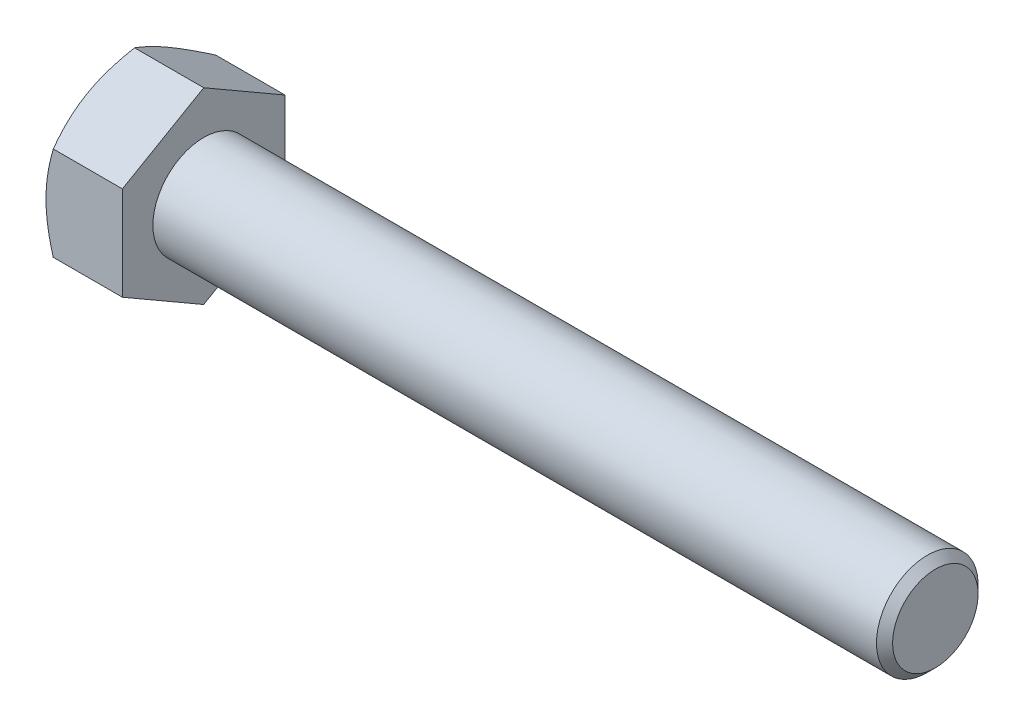
ISO-10303-21;
HEADER;
FILE_DESCRIPTION(('STEP AP214'),'2;1');
FILE_NAME('part.step','',(''),(''),'','','');
FILE_SCHEMA(('AUTOMOTIVE_DESIGN { 1 0 10303 214 1 1 1 1 }'));
ENDSEC;
DATA;
#1=APPLICATION_CONTEXT('core data for automotive mechanical design processes');
#2=APPLICATION_PROTOCOL_DEFINITION('international standard','automotive_design',2000,#1);
#3=PRODUCT_CONTEXT('',#1,'mechanical');
#4=PRODUCT('Part','Part','',(#3));
#5=PRODUCT_RELATED_PRODUCT_CATEGORY('part','',(#4));
#6=PRODUCT_DEFINITION_FORMATION('','',#4);
#7=PRODUCT_DEFINITION_CONTEXT('part definition',#1,'design');
#8=PRODUCT_DEFINITION('design','',#6,#7);
#9=PRODUCT_DEFINITION_SHAPE('','',#8);
#10=(LENGTH_UNIT() NAMED_UNIT(*) SI_UNIT(.MILLI.,.METRE.));
#11=(NAMED_UNIT(*) PLANE_ANGLE_UNIT() SI_UNIT($,.RADIAN.));
#12=(NAMED_UNIT(*) SI_UNIT($,.STERADIAN.) SOLID_ANGLE_UNIT());
#13=UNCERTAINTY_MEASURE_WITH_UNIT(LENGTH_MEASURE(1.E-05),#10,'distance_accuracy_value','');
#14=(GEOMETRIC_REPRESENTATION_CONTEXT(3) GLOBAL_UNCERTAINTY_ASSIGNED_CONTEXT((#13)) GLOBAL_UNIT_ASSIGNED_CONTEXT((#10,
#11,#12)) REPRESENTATION_CONTEXT('',''));
#15=CARTESIAN_POINT('',(0.,0.,0.));
#16=DIRECTION('',(0.,0.,1.));
#17=DIRECTION('',(1.,0.,0.));
#18=AXIS2_PLACEMENT_3D('',#15,#16,#17);
#19=CARTESIAN_POINT('',(5.969,3.66617420935412,-6.35));
#20=DIRECTION('',(0.,-0.866025403784438,0.500000000000001));
#21=DIRECTION('',(0.,-0.500000000000001,-0.866025403784438));
#22=AXIS2_PLACEMENT_3D('',#19,#20,#21);
#23=PLANE('',#22);
#24=CARTESIAN_POINT('',(0.56722579222065,7.33246388876209,0.0002));
#25=CARTESIAN_POINT('',(0.520705795885481,7.25187715009445,-0.13938032578862));
#26=CARTESIAN_POINT('',(0.476297032585863,7.17098994497989,-0.279481074729296));
#27=CARTESIAN_POINT('',(0.392283450452388,7.00855864282177,-0.560820342806735));
#28=CARTESIAN_POINT('',(0.352680703976116,6.92701427845871,-0.70205932495446));
#29=CARTESIAN_POINT('',(0.24185882380987,6.68107555195828,-1.12803769480199));
#30=CARTESIAN_POINT('',(0.178824482202446,6.51571038378533,-1.41445856787971));
#31=CARTESIAN_POINT('',(0.104909071695574,6.26824441683674,-1.84308219577882));
#32=CARTESIAN_POINT('',(0.083852667933203,6.18688302502749,-1.98400426016695));
#33=CARTESIAN_POINT('',(0.0485440446617521,6.02379260806586,-2.26648514857209));
#34=CARTESIAN_POINT('',(0.0342912239672214,5.94206361604021,-2.40804391521191));
#35=CARTESIAN_POINT('',(0.0129530042780835,5.77846368249352,-2.69140731222966));
#36=CARTESIAN_POINT('',(0.00585947102329061,5.69659300817866,-2.83321147979293));
#37=CARTESIAN_POINT('',(-0.00101567917148086,5.53278054688489,-3.11694298566665));
#38=CARTESIAN_POINT('',(-0.000797521989078246,5.45083876218098,-3.2588703200367));
#39=CARTESIAN_POINT('',(0.00985057652705666,5.22634399461133,-3.64770666350069));
#40=CARTESIAN_POINT('',(0.0277266404085343,5.08386449580427,-3.89448839447146));
#41=CARTESIAN_POINT('',(0.0844122058574267,4.79985183690218,-4.38641274968262));
#42=CARTESIAN_POINT('',(0.123241082865866,4.65831967566048,-4.63155364385826));
#43=CARTESIAN_POINT('',(0.220302170250006,4.37373542545027,-5.12446802425625));
#44=CARTESIAN_POINT('',(0.278945624959316,4.23071924628532,-5.37217931287431));
#45=CARTESIAN_POINT('',(0.41204266871068,3.94681968285054,-5.86390778098996));
#46=CARTESIAN_POINT('',(0.486464993107676,3.80593266266769,-6.10793125807364));
#47=CARTESIAN_POINT('',(0.567225792220645,3.66605873930028,-6.3502));
#48=B_SPLINE_CURVE_WITH_KNOTS('',3,(#24,#25,#26,#27,#28,#29,#30,#31,#32,#33,#34,#35,#36,#37,#38,
#39,#40,#41,#42,#43,#44,#45,#46,#47),.UNSPECIFIED.,.F.,.F.,(4,2,2,2,2,2,2,2,2,2,2,4),(0.,
0.503218195050232,1.00665261286994,2.01561339063536,2.50773694105499,2.99981699787608,
3.49133733019735,3.9828424781586,4.83850206575152,5.69495425638523,6.57040160519864,
7.44413026658513),.UNSPECIFIED.);
#49=CARTESIAN_POINT('',(0.567159123979205,7.33234841870825,0.));
#50=VERTEX_POINT('',#49);
#51=CARTESIAN_POINT('',(0.,5.49926131403118,-3.17500000000001));
#52=VERTEX_POINT('',#51);
#53=EDGE_CURVE('E49',#50,#52,#48,.T.);
#54=ORIENTED_EDGE('',*,*,#53,.F.);
#55=DIRECTION('',(-1.,0.,0.));
#56=VECTOR('',#55,1.);
#57=CARTESIAN_POINT('',(5.969,7.33234841870825,0.));
#58=LINE('',#57,#56);
#59=CARTESIAN_POINT('',(5.969,7.33234841870825,0.));
#60=VERTEX_POINT('',#59);
#61=EDGE_CURVE('E145',#60,#50,#58,.T.);
#62=ORIENTED_EDGE('',*,*,#61,.F.);
#63=DIRECTION('',(0.,0.500000000000001,0.866025403784438));
#64=VECTOR('',#63,1.);
#65=CARTESIAN_POINT('',(5.969,3.66617420935412,-6.35));
#66=LINE('',#65,#64);
#67=CARTESIAN_POINT('',(5.969,3.66617420935412,-6.35));
#68=VERTEX_POINT('',#67);
#69=EDGE_CURVE('E230',#68,#60,#66,.T.);
#70=ORIENTED_EDGE('',*,*,#69,.F.);
#71=DIRECTION('',(-1.,0.,0.));
#72=VECTOR('',#71,1.);
#73=CARTESIAN_POINT('',(5.969,3.66617420935412,-6.35));
#74=LINE('',#73,#72);
#75=CARTESIAN_POINT('',(0.5671591239792,3.66617420935412,-6.35));
#76=VERTEX_POINT('',#75);
#77=EDGE_CURVE('E133',#68,#76,#74,.T.);
#78=ORIENTED_EDGE('',*,*,#77,.T.);
#79=EDGE_CURVE('E127',#52,#76,#48,.T.);
#80=ORIENTED_EDGE('',*,*,#79,.F.);
#81=EDGE_LOOP('',(#54,#62,#70,#78,#80));
#82=FACE_BOUND('',#81,.T.);
#83=ADVANCED_FACE('F33',(#82),#23,.F.);
#84=CARTESIAN_POINT('',(5.969,7.33234841870825,0.));
#85=DIRECTION('',(0.,-0.866025403784438,-0.500000000000001));
#86=DIRECTION('',(0.,0.500000000000001,-0.866025403784438));
#87=AXIS2_PLACEMENT_3D('',#84,#85,#86);
#88=PLANE('',#87);
#89=CARTESIAN_POINT('',(0.567225792220646,3.66605873930028,6.3502));
#90=CARTESIAN_POINT('',(0.520705795885477,3.74664547796792,6.21061967421138));
#91=CARTESIAN_POINT('',(0.476297032585859,3.82753268308249,6.0705189252707));
#92=CARTESIAN_POINT('',(0.392283450452384,3.98996398524061,5.78917965719326));
#93=CARTESIAN_POINT('',(0.352680703976113,4.07150834960366,5.64794067504554));
#94=CARTESIAN_POINT('',(0.241858823809868,4.3174470761041,5.22196230519801));
#95=CARTESIAN_POINT('',(0.178824482202444,4.48281224427704,4.93554143212029));
#96=CARTESIAN_POINT('',(0.104909071695573,4.73027821122563,4.50691780422118));
#97=CARTESIAN_POINT('',(0.083852667933202,4.81163960303488,4.36599573983305));
#98=CARTESIAN_POINT('',(0.0485440446617515,4.97473001999651,4.08351485142791));
#99=CARTESIAN_POINT('',(0.0342912239672208,5.05645901202216,3.94195608478809));
#100=CARTESIAN_POINT('',(0.0129530042780833,5.22005894556885,3.65859268777034));
#101=CARTESIAN_POINT('',(0.00585947102329089,5.30192961988371,3.51678852020708));
#102=CARTESIAN_POINT('',(-0.00101567917147989,5.46574208117748,3.23305701433336));
#103=CARTESIAN_POINT('',(-0.000797521989076991,5.54768386588139,3.0911296799633));
#104=CARTESIAN_POINT('',(0.00985057652705825,5.77217863345104,2.70229333649931));
#105=CARTESIAN_POINT('',(0.0277266404085356,5.9146581322581,2.45551160552854));
#106=CARTESIAN_POINT('',(0.0844122058574286,6.19867079116019,1.96358725031738));
#107=CARTESIAN_POINT('',(0.123241082865869,6.34020295240188,1.71844635614174));
#108=CARTESIAN_POINT('',(0.22030217025001,6.6247872026121,1.22553197574375));
#109=CARTESIAN_POINT('',(0.27894562495932,6.76780338177705,0.977820687125688));
#110=CARTESIAN_POINT('',(0.412042668710684,7.05170294521183,0.486092219010036));
#111=CARTESIAN_POINT('',(0.48646499310768,7.19258996539468,0.242068741926359));
#112=CARTESIAN_POINT('',(0.567225792220649,7.33246388876209,-0.000199999999999471));
#113=B_SPLINE_CURVE_WITH_KNOTS('',3,(#89,#90,#91,#92,#93,#94,#95,#96,#97,#98,#99,#100,#101,#102,
#103,#104,#105,#106,#107,#108,#109,#110,#111,#112),.UNSPECIFIED.,.F.,.F.,(4,2,2,2,2,2,2,2,2,2,2,
4),(0.,0.503218195050232,1.00665261286994,2.01561339063536,2.50773694105499,2.99981699787608,
3.49133733019734,3.9828424781586,4.83850206575152,5.69495425638522,6.57040160519864,
7.44413026658512),.UNSPECIFIED.);
#114=CARTESIAN_POINT('',(0.567159123979201,3.66617420935412,6.35));
#115=VERTEX_POINT('',#114);
#116=CARTESIAN_POINT('',(0.,5.49926131403118,3.17500000000001));
#117=VERTEX_POINT('',#116);
#118=EDGE_CURVE('E56',#115,#117,#113,.T.);
#119=ORIENTED_EDGE('',*,*,#118,.F.);
#120=DIRECTION('',(-1.,0.,0.));
#121=VECTOR('',#120,1.);
#122=CARTESIAN_POINT('',(5.969,3.66617420935412,6.35));
#123=LINE('',#122,#121);
#124=CARTESIAN_POINT('',(5.969,3.66617420935412,6.35));
#125=VERTEX_POINT('',#124);
#126=EDGE_CURVE('E143',#125,#115,#123,.T.);
#127=ORIENTED_EDGE('',*,*,#126,.F.);
#128=DIRECTION('',(0.,-0.500000000000001,0.866025403784438));
#129=VECTOR('',#128,1.);
#130=CARTESIAN_POINT('',(5.969,7.33234841870825,0.));
#131=LINE('',#130,#129);
#132=EDGE_CURVE('E228',#60,#125,#131,.T.);
#133=ORIENTED_EDGE('',*,*,#132,.F.);
#134=ORIENTED_EDGE('',*,*,#61,.T.);
#135=EDGE_CURVE('E160',#117,#50,#113,.T.);
#136=ORIENTED_EDGE('',*,*,#135,.F.);
#137=EDGE_LOOP('',(#119,#127,#133,#134,#136));
#138=FACE_BOUND('',#137,.T.);
#139=ADVANCED_FACE('F166',(#138),#88,.F.);
#140=CARTESIAN_POINT('',(5.969,3.66617420935412,6.35));
#141=DIRECTION('',(0.,0.,-1.));
#142=DIRECTION('',(-1.,0.,0.));
#143=AXIS2_PLACEMENT_3D('',#140,#141,#142);
#144=PLANE('',#143);
#145=CARTESIAN_POINT('',(3.14367601755403,-9.9398028319864,6.35));
#146=CARTESIAN_POINT('',(3.00837198029771,-9.66163438687443,6.35));
#147=CARTESIAN_POINT('',(2.87433908027307,-9.38283710730511,6.35));
#148=CARTESIAN_POINT('',(2.60952879037522,-8.82365074911731,6.35));
#149=CARTESIAN_POINT('',(2.47875189635368,-8.54326143593898,6.35));
#150=CARTESIAN_POINT('',(2.22052868772128,-7.97915634696428,6.35));
#151=CARTESIAN_POINT('',(2.09310359186348,-7.69543082522701,6.35));
#152=CARTESIAN_POINT('',(1.84334767414878,-7.12575465379769,6.35));
#153=CARTESIAN_POINT('',(1.72101661744908,-6.83980410740554,6.35));
#154=CARTESIAN_POINT('',(1.4788519738677,-6.25572302707621,6.35));
#155=CARTESIAN_POINT('',(1.35923464654652,-5.9575023498181,6.35));
#156=CARTESIAN_POINT('',(1.12883238942455,-5.35760609479501,6.35));
#157=CARTESIAN_POINT('',(1.01804843752938,-5.05593013872692,6.35));
#158=CARTESIAN_POINT('',(0.808153098255221,-4.44917964545297,6.35));
#159=CARTESIAN_POINT('',(0.70901887584244,-4.14411308466492,6.35));
#160=CARTESIAN_POINT('',(0.525543834192883,-3.52960171995186,6.35));
#161=CARTESIAN_POINT('',(0.441198453590936,-3.22015829792944,6.35));
#162=CARTESIAN_POINT('',(0.291727586386875,-2.59842911342063,6.35));
#163=CARTESIAN_POINT('',(0.226496888329708,-2.28616904994311,6.35));
#164=CARTESIAN_POINT('',(0.118904571828102,-1.65762730788837,6.35));
#165=CARTESIAN_POINT('',(0.0765405573459598,-1.34134605421932,6.35));
#166=CARTESIAN_POINT('',(0.0329533459299357,-0.867275016888795,6.35));
#167=CARTESIAN_POINT('',(0.0217606490874793,-0.710363798925244,6.35));
#168=CARTESIAN_POINT('',(0.00601970866108328,-0.396201526465933,6.35));
#169=CARTESIAN_POINT('',(0.00147135206033235,-0.238950477796082,6.35));
#170=CARTESIAN_POINT('',(-0.000864873693704532,0.0756024820110034,6.35));
#171=CARTESIAN_POINT('',(0.00134730804231395,0.232904393522192,6.35));
#172=CARTESIAN_POINT('',(0.0124750937047342,0.547273259965601,6.35));
#173=CARTESIAN_POINT('',(0.0213910154873181,0.704340203403027,6.35));
#174=CARTESIAN_POINT('',(0.0504634057547387,1.07899586027898,6.35));
#175=CARTESIAN_POINT('',(0.0736436238822159,1.2963550957377,6.35));
#176=CARTESIAN_POINT('',(0.131599604348193,1.72951065205878,6.35));
#177=CARTESIAN_POINT('',(0.166376861833685,1.94530676772894,6.35));
#178=CARTESIAN_POINT('',(0.286264257854856,2.59006925980297,6.35));
#179=CARTESIAN_POINT('',(0.386910475193506,3.01618787228099,6.35));
#180=CARTESIAN_POINT('',(0.562116784628251,3.65361272982346,6.35));
#181=CARTESIAN_POINT('',(0.625415304913839,3.86820484032543,6.35));
#182=CARTESIAN_POINT('',(0.758751353425601,4.2953057565738,6.35));
#183=CARTESIAN_POINT('',(0.828788931820659,4.50781454679795,6.35));
#184=CARTESIAN_POINT('',(0.974465563814959,4.93081468737571,6.35));
#185=CARTESIAN_POINT('',(1.05010294252176,5.14130661986487,6.35));
#186=CARTESIAN_POINT('',(1.20607264760709,5.56053331579622,6.35));
#187=CARTESIAN_POINT('',(1.2864048779937,5.76926811506536,6.35));
#188=CARTESIAN_POINT('',(1.50347781751132,6.31783828344515,6.35));
#189=CARTESIAN_POINT('',(1.64351404320345,6.65636817400488,6.35));
#190=CARTESIAN_POINT('',(1.93147973510731,7.330066017539,6.35));
#191=CARTESIAN_POINT('',(2.07940998438119,7.66523363305406,6.35));
#192=CARTESIAN_POINT('',(2.38134633815376,8.33295246114885,6.35));
#193=CARTESIAN_POINT('',(2.53535453751782,8.6655027234018,6.35));
#194=CARTESIAN_POINT('',(2.84803388547347,9.32838207907319,6.35));
#195=CARTESIAN_POINT('',(3.00670486567662,9.6587112521744,6.35));
#196=CARTESIAN_POINT('',(3.32795966755858,10.3180684957328,6.35));
#197=CARTESIAN_POINT('',(3.49054898052715,10.6470938852597,6.35));
#198=CARTESIAN_POINT('',(3.81866781799733,11.3036759425,6.35));
#199=CARTESIAN_POINT('',(3.98419736411602,11.6312325993929,6.35));
#200=CARTESIAN_POINT('',(4.31759864974133,12.2850676249536,6.35));
#201=CARTESIAN_POINT('',(4.48546991323898,12.6113462366289,6.35));
#202=CARTESIAN_POINT('',(4.82315890277014,13.2628952011192,6.35));
#203=CARTESIAN_POINT('',(4.99297663652365,13.5881655499288,6.35));
#204=CARTESIAN_POINT('',(5.47018031685672,14.4967378639502,6.35));
#205=CARTESIAN_POINT('',(5.77935148177735,15.0791020152928,6.35));
#206=CARTESIAN_POINT('',(6.40147296847065,16.2418453877032,6.35));
#207=CARTESIAN_POINT('',(6.71442349983108,16.8222244963774,6.35));
#208=CARTESIAN_POINT('',(7.34215184678349,17.9796171047036,6.35));
#209=CARTESIAN_POINT('',(7.65692074956543,18.5566354431591,6.35));
#210=CARTESIAN_POINT('',(8.28862904640645,19.7094283212459,6.35));
#211=CARTESIAN_POINT('',(8.60556827976308,20.2852029489025,6.35));
#212=CARTESIAN_POINT('',(8.9232990698036,20.8605372016132,6.35));
#213=B_SPLINE_CURVE_WITH_KNOTS('',3,(#145,#146,#147,#148,#149,#150,#151,#152,#153,#154,#155,
#156,#157,#158,#159,#160,#161,#162,#163,#164,#165,#166,#167,#168,#169,#170,#171,#172,#173,#174,
#175,#176,#177,#178,#179,#180,#181,#182,#183,#184,#185,#186,#187,#188,#189,#190,#191,#192,#193,
#194,#195,#196,#197,#198,#199,#200,#201,#202,#203,#204,#205,#206,#207,#208,#209,#210,#211,#212),
.UNSPECIFIED.,.F.,.F.,(4,2,2,2,2,2,2,2,2,2,2,2,2,2,2,2,2,2,2,2,2,2,2,2,2,2,2,2,2,2,2,2,2,4),(0.,
0.928000025771648,1.85614052122796,2.78917912474404,3.72217466606163,4.68601414241722,
5.64996017364175,6.61198406033347,7.57371070325733,8.53003982946587,9.48626872926092,
9.95807916799836,10.4298815813894,10.9016875462366,11.3735158830582,12.0289230702765,
12.6844147884824,13.9960635141582,14.667204090962,15.338349664455,16.0092953039748,
16.6802272299963,17.7791313314936,18.8781446441682,19.9775401158916,21.0768959334805,
22.1778940812193,23.2789003270287,24.379685937715,25.480475915801,27.4584871219283,
29.4366085285952,31.408472007269,33.380191024666),.UNSPECIFIED.);
#214=CARTESIAN_POINT('',(0.567159123979203,-3.66617420935413,6.35));
#215=VERTEX_POINT('',#214);
#216=CARTESIAN_POINT('',(0.,0.,6.35));
#217=VERTEX_POINT('',#216);
#218=EDGE_CURVE('E240',#215,#217,#213,.T.);
#219=ORIENTED_EDGE('',*,*,#218,.F.);
#220=DIRECTION('',(-1.,0.,0.));
#221=VECTOR('',#220,1.);
#222=CARTESIAN_POINT('',(5.969,-3.66617420935413,6.35));
#223=LINE('',#222,#221);
#224=CARTESIAN_POINT('',(5.969,-3.66617420935413,6.35));
#225=VERTEX_POINT('',#224);
#226=EDGE_CURVE('E135',#225,#215,#223,.T.);
#227=ORIENTED_EDGE('',*,*,#226,.F.);
#228=DIRECTION('',(0.,-1.,0.));
#229=VECTOR('',#228,1.);
#230=CARTESIAN_POINT('',(5.969,3.66617420935412,6.35));
#231=LINE('',#230,#229);
#232=EDGE_CURVE('E224',#125,#225,#231,.T.);
#233=ORIENTED_EDGE('',*,*,#232,.F.);
#234=ORIENTED_EDGE('',*,*,#126,.T.);
#235=EDGE_CURVE('E182',#217,#115,#213,.T.);
#236=ORIENTED_EDGE('',*,*,#235,.F.);
#237=EDGE_LOOP('',(#219,#227,#233,#234,#236));
#238=FACE_BOUND('',#237,.T.);
#239=ADVANCED_FACE('F246',(#238),#144,.F.);
#240=CARTESIAN_POINT('',(5.969,-7.33234841870826,0.));
#241=DIRECTION('',(0.,0.866025403784438,-0.500000000000001));
#242=DIRECTION('',(0.,0.500000000000001,0.866025403784438));
#243=AXIS2_PLACEMENT_3D('',#240,#241,#242);
#244=PLANE('',#243);
#245=CARTESIAN_POINT('',(0.567225792220657,-7.3324638887621,-0.000200000000000018));
#246=CARTESIAN_POINT('',(0.520705795885488,-7.25187715009447,0.13938032578862));
#247=CARTESIAN_POINT('',(0.476297032585869,-7.1709899449799,0.279481074729295));
#248=CARTESIAN_POINT('',(0.392283450452394,-7.00855864282178,0.560820342806734));
#249=CARTESIAN_POINT('',(0.352680703976123,-6.92701427845872,0.70205932495446));
#250=CARTESIAN_POINT('',(0.241858823809876,-6.68107555195829,1.12803769480199));
#251=CARTESIAN_POINT('',(0.178824482202452,-6.51571038378534,1.41445856787971));
#252=CARTESIAN_POINT('',(0.10490907169558,-6.26824441683675,1.84308219577883));
#253=CARTESIAN_POINT('',(0.0838526679332088,-6.18688302502751,1.98400426016695));
#254=CARTESIAN_POINT('',(0.0485440446617578,-6.02379260806587,2.26648514857209));
#255=CARTESIAN_POINT('',(0.0342912239672271,-5.94206361604022,2.40804391521192));
#256=CARTESIAN_POINT('',(0.0129530042780892,-5.77846368249353,2.69140731222967));
#257=CARTESIAN_POINT('',(0.00585947102329639,-5.69659300817867,2.83321147979293));
#258=CARTESIAN_POINT('',(-0.00101567917147513,-5.5327805468849,3.11694298566665));
#259=CARTESIAN_POINT('',(-0.000797521989072555,-5.45083876218099,3.2588703200367));
#260=CARTESIAN_POINT('',(0.00985057652706217,-5.22634399461134,3.6477066635007));
#261=CARTESIAN_POINT('',(0.0277266404085396,-5.08386449580428,3.89448839447147));
#262=CARTESIAN_POINT('',(0.0844122058574319,-4.79985183690218,4.38641274968263));
#263=CARTESIAN_POINT('',(0.123241082865872,-4.65831967566049,4.63155364385826));
#264=CARTESIAN_POINT('',(0.220302170250011,-4.37373542545028,5.12446802425625));
#265=CARTESIAN_POINT('',(0.278945624959321,-4.23071924628533,5.37217931287431));
#266=CARTESIAN_POINT('',(0.412042668710684,-3.94681968285055,5.86390778098997));
#267=CARTESIAN_POINT('',(0.486464993107679,-3.80593266266771,6.10793125807364));
#268=CARTESIAN_POINT('',(0.567225792220648,-3.66605873930029,6.3502));
#269=B_SPLINE_CURVE_WITH_KNOTS('',3,(#245,#246,#247,#248,#249,#250,#251,#252,#253,#254,#255,
#256,#257,#258,#259,#260,#261,#262,#263,#264,#265,#266,#267,#268),.UNSPECIFIED.,.F.,.F.,(4,2,2,
2,2,2,2,2,2,2,2,4),(0.,0.503218195050232,1.00665261286994,2.01561339063536,2.50773694105499,
2.99981699787609,3.49133733019735,3.98284247815861,4.83850206575153,5.69495425638523,
6.57040160519865,7.44413026658513),.UNSPECIFIED.);
#270=CARTESIAN_POINT('',(0.567159123979211,-7.33234841870826,0.));
#271=VERTEX_POINT('',#270);
#272=CARTESIAN_POINT('',(0.,-5.49926131403118,3.17500000000001));
#273=VERTEX_POINT('',#272);
#274=EDGE_CURVE('E168',#271,#273,#269,.T.);
#275=ORIENTED_EDGE('',*,*,#274,.F.);
#276=DIRECTION('',(-1.,0.,0.));
#277=VECTOR('',#276,1.);
#278=CARTESIAN_POINT('',(5.969,-7.33234841870826,0.));
#279=LINE('',#278,#277);
#280=CARTESIAN_POINT('',(5.969,-7.33234841870826,0.));
#281=VERTEX_POINT('',#280);
#282=EDGE_CURVE('E132',#281,#271,#279,.T.);
#283=ORIENTED_EDGE('',*,*,#282,.F.);
#284=DIRECTION('',(0.,-0.500000000000001,-0.866025403784438));
#285=VECTOR('',#284,1.);
#286=CARTESIAN_POINT('',(5.969,-7.33234841870826,0.));
#287=LINE('',#286,#285);
#288=EDGE_CURVE('E222',#225,#281,#287,.T.);
#289=ORIENTED_EDGE('',*,*,#288,.F.);
#290=ORIENTED_EDGE('',*,*,#226,.T.);
#291=EDGE_CURVE('E170',#273,#215,#269,.T.);
#292=ORIENTED_EDGE('',*,*,#291,.F.);
#293=EDGE_LOOP('',(#275,#283,#289,#290,#292));
#294=FACE_BOUND('',#293,.T.);
#295=ADVANCED_FACE('F218',(#294),#244,.F.);
#296=CARTESIAN_POINT('',(5.969,-3.66617420935413,-6.35));
#297=DIRECTION('',(0.,0.866025403784438,0.500000000000001));
#298=DIRECTION('',(0.,-0.500000000000001,0.866025403784438));
#299=AXIS2_PLACEMENT_3D('',#296,#297,#298);
#300=PLANE('',#299);
#301=CARTESIAN_POINT('',(0.56722579222065,-3.6660587393003,-6.3502));
#302=CARTESIAN_POINT('',(0.520705795885481,-3.74664547796793,-6.21061967421138));
#303=CARTESIAN_POINT('',(0.476297032585863,-3.8275326830825,-6.07051892527071));
#304=CARTESIAN_POINT('',(0.392283450452389,-3.98996398524062,-5.78917965719326));
#305=CARTESIAN_POINT('',(0.352680703976118,-4.07150834960368,-5.64794067504554));
#306=CARTESIAN_POINT('',(0.241858823809873,-4.31744707610411,-5.22196230519801));
#307=CARTESIAN_POINT('',(0.178824482202449,-4.48281224427706,-4.93554143212029));
#308=CARTESIAN_POINT('',(0.104909071695578,-4.73027821122565,-4.50691780422117));
#309=CARTESIAN_POINT('',(0.0838526679332071,-4.81163960303489,-4.36599573983305));
#310=CARTESIAN_POINT('',(0.0485440446617569,-4.97473001999652,-4.08351485142791));
#311=CARTESIAN_POINT('',(0.0342912239672263,-5.05645901202218,-3.94195608478808));
#312=CARTESIAN_POINT('',(0.0129530042780891,-5.22005894556886,-3.65859268777033));
#313=CARTESIAN_POINT('',(0.00585947102329682,-5.30192961988372,-3.51678852020707));
#314=CARTESIAN_POINT('',(-0.00101567917147381,-5.46574208117749,-3.23305701433335));
#315=CARTESIAN_POINT('',(-0.000797521989070929,-5.54768386588141,-3.0911296799633));
#316=CARTESIAN_POINT('',(0.0098505765270645,-5.77217863345105,-2.70229333649931));
#317=CARTESIAN_POINT('',(0.0277266404085423,-5.91465813225811,-2.45551160552853));
#318=CARTESIAN_POINT('',(0.0844122058574358,-6.19867079116021,-1.96358725031738));
#319=CARTESIAN_POINT('',(0.123241082865876,-6.3402029524019,-1.71844635614174));
#320=CARTESIAN_POINT('',(0.220302170250017,-6.62478720261212,-1.22553197574375));
#321=CARTESIAN_POINT('',(0.278945624959327,-6.76780338177706,-0.977820687125687));
#322=CARTESIAN_POINT('',(0.412042668710691,-7.05170294521184,-0.486092219010034));
#323=CARTESIAN_POINT('',(0.486464993107687,-7.19258996539469,-0.242068741926357));
#324=CARTESIAN_POINT('',(0.567225792220656,-7.3324638887621,0.000199999999999915));
#325=B_SPLINE_CURVE_WITH_KNOTS('',3,(#301,#302,#303,#304,#305,#306,#307,#308,#309,#310,#311,
#312,#313,#314,#315,#316,#317,#318,#319,#320,#321,#322,#323,#324),.UNSPECIFIED.,.F.,.F.,(4,2,2,
2,2,2,2,2,2,2,2,4),(0.,0.503218195050231,1.00665261286994,2.01561339063536,2.50773694105499,
2.99981699787608,3.49133733019735,3.9828424781586,4.83850206575152,5.69495425638523,
6.57040160519864,7.44413026658513),.UNSPECIFIED.);
#326=CARTESIAN_POINT('',(0.567159123978881,-3.66617420935462,-6.35));
#327=VERTEX_POINT('',#326);
#328=CARTESIAN_POINT('',(0.,-5.49926131403118,-3.175));
#329=VERTEX_POINT('',#328);
#330=EDGE_CURVE('E109',#327,#329,#325,.T.);
#331=ORIENTED_EDGE('',*,*,#330,.F.);
#332=DIRECTION('',(-1.,0.,0.));
#333=VECTOR('',#332,1.);
#334=CARTESIAN_POINT('',(5.969,-3.66617420935413,-6.35));
#335=LINE('',#334,#333);
#336=CARTESIAN_POINT('',(5.969,-3.66617420935413,-6.35));
#337=VERTEX_POINT('',#336);
#338=EDGE_CURVE('E123',#337,#327,#335,.T.);
#339=ORIENTED_EDGE('',*,*,#338,.F.);
#340=DIRECTION('',(0.,0.500000000000001,-0.866025403784438));
#341=VECTOR('',#340,1.);
#342=CARTESIAN_POINT('',(5.969,-3.66617420935413,-6.35));
#343=LINE('',#342,#341);
#344=EDGE_CURVE('E220',#281,#337,#343,.T.);
#345=ORIENTED_EDGE('',*,*,#344,.F.);
#346=ORIENTED_EDGE('',*,*,#282,.T.);
#347=EDGE_CURVE('E126',#329,#271,#325,.T.);
#348=ORIENTED_EDGE('',*,*,#347,.F.);
#349=EDGE_LOOP('',(#331,#339,#345,#346,#348));
#350=FACE_BOUND('',#349,.T.);
#351=ADVANCED_FACE('F121',(#350),#300,.F.);
#352=CARTESIAN_POINT('',(5.969,3.66617420935412,-6.35));
#353=DIRECTION('',(0.,0.,1.));
#354=DIRECTION('',(0.,-1.,0.));
#355=AXIS2_PLACEMENT_3D('',#352,#353,#354);
#356=PLANE('',#355);
#357=CARTESIAN_POINT('',(3.14367601861731,-9.93980283417178,-6.35));
#358=CARTESIAN_POINT('',(3.00837198131659,-9.66163438898627,-6.35));
#359=CARTESIAN_POINT('',(2.8743390812476,-9.38283710934336,-6.35));
#360=CARTESIAN_POINT('',(2.60952879126123,-8.82365075100816,-6.35));
#361=CARTESIAN_POINT('',(2.47875189719555,-8.54326143775602,-6.35));
#362=CARTESIAN_POINT('',(2.22052868847481,-7.97915634863256,-6.35));
#363=CARTESIAN_POINT('',(2.09310359257285,-7.69543082682033,-6.35));
#364=CARTESIAN_POINT('',(1.84334767477054,-7.12575465524061,-6.35));
#365=CARTESIAN_POINT('',(1.72101661802741,-6.839804108773,-6.35));
#366=CARTESIAN_POINT('',(1.47885197435794,-6.25572302828696,-6.35));
#367=CARTESIAN_POINT('',(1.3592346469922,-5.95750235094756,-6.35));
#368=CARTESIAN_POINT('',(1.1288323897835,-5.35760609576056,-6.35));
#369=CARTESIAN_POINT('',(1.01804843784615,-5.05593013960987,-6.35));
#370=CARTESIAN_POINT('',(0.808153098491675,-4.44917964616918,-6.35));
#371=CARTESIAN_POINT('',(0.709018876040742,-4.144113085297,-6.35));
#372=CARTESIAN_POINT('',(0.525543834321108,-3.52960172041338,-6.35));
#373=CARTESIAN_POINT('',(0.441198453687234,-3.22015829830454,-6.35));
#374=CARTESIAN_POINT('',(0.291727586418746,-2.59842911357849,-6.35));
#375=CARTESIAN_POINT('',(0.226496888331553,-2.28616904996955,-6.35));
#376=CARTESIAN_POINT('',(0.118904571789759,-1.65762730764876,-6.35));
#377=CARTESIAN_POINT('',(0.0765405572974408,-1.34134605384508,-6.35));
#378=CARTESIAN_POINT('',(0.0329533458840343,-0.867275016313545,-6.35));
#379=CARTESIAN_POINT('',(0.0217606490453511,-0.710363798283965,-6.35));
#380=CARTESIAN_POINT('',(0.00601970863232366,-0.396201525692717,-6.35));
#381=CARTESIAN_POINT('',(0.00147135204116819,-0.238950476956959,-6.35));
#382=CARTESIAN_POINT('',(-0.000864873687976419,0.0756024829814481,-6.35));
#383=CARTESIAN_POINT('',(0.00134730806333997,0.23290439455805,-6.35));
#384=CARTESIAN_POINT('',(0.0124750937616494,0.547273261131435,-6.35));
#385=CARTESIAN_POINT('',(0.0213910155648251,0.704340204633422,-6.35));
#386=CARTESIAN_POINT('',(0.050463405882883,1.07899586160911,-6.35));
#387=CARTESIAN_POINT('',(0.0736436240395076,1.29635509710271,-6.35));
#388=CARTESIAN_POINT('',(0.131599604565339,1.72951065349199,-6.35));
#389=CARTESIAN_POINT('',(0.166376862081539,1.94530676919546,-6.35));
#390=CARTESIAN_POINT('',(0.286264258195476,2.59006926136762,-6.35));
#391=CARTESIAN_POINT('',(0.386910475596789,3.01618787390849,-6.35));
#392=CARTESIAN_POINT('',(0.562116785124008,3.65361273154498,-6.35));
#393=CARTESIAN_POINT('',(0.625415305440635,3.86820484207896,-6.35));
#394=CARTESIAN_POINT('',(0.75875135401353,4.29530575839099,-6.35));
#395=CARTESIAN_POINT('',(0.828788932438683,4.50781454864679,-6.35));
#396=CARTESIAN_POINT('',(0.974465564492099,4.93081468928762,-6.35));
#397=CARTESIAN_POINT('',(1.05010294322792,5.1413066218082,-6.35));
#398=CARTESIAN_POINT('',(1.20607264837028,5.56053331780239,-6.35));
#399=CARTESIAN_POINT('',(1.28640487878491,5.76926811710295,-6.35));
#400=CARTESIAN_POINT('',(1.50347781834975,6.31783828550136,-6.35));
#401=CARTESIAN_POINT('',(1.64351404405831,6.65636817604915,-6.35));
#402=CARTESIAN_POINT('',(1.93147973599044,7.33006601956088,-6.35));
#403=CARTESIAN_POINT('',(2.07940998527614,7.6652336350655,-6.35));
#404=CARTESIAN_POINT('',(2.38134633906898,8.33295246314052,-6.35));
#405=CARTESIAN_POINT('',(2.53535453844148,8.66550272538414,-6.35));
#406=CARTESIAN_POINT('',(2.8480338864116,9.32838208103787,-6.35));
#407=CARTESIAN_POINT('',(3.00670486662078,9.65871125413076,-6.35));
#408=CARTESIAN_POINT('',(3.32795966851281,10.3180684976728,-6.35));
#409=CARTESIAN_POINT('',(3.49054898148539,10.6470938871917,-6.35));
#410=CARTESIAN_POINT('',(3.81866781896226,11.3036759444165,-6.35));
#411=CARTESIAN_POINT('',(3.98419736508361,11.6312326013019,-6.35));
#412=CARTESIAN_POINT('',(4.31759865071328,12.2850676268483,-6.35));
#413=CARTESIAN_POINT('',(4.48546991421262,12.6113462385166,-6.35));
#414=CARTESIAN_POINT('',(4.82315890374638,13.2628952029936,-6.35));
#415=CARTESIAN_POINT('',(4.99297663750079,13.5881655517967,-6.35));
#416=CARTESIAN_POINT('',(5.47018031784119,14.4967378658111,-6.35));
#417=CARTESIAN_POINT('',(5.77935148276767,15.0791020171534,-6.35));
#418=CARTESIAN_POINT('',(6.40147296947148,16.241845389564,-6.35));
#419=CARTESIAN_POINT('',(6.71442350083658,16.8222244982386,-6.35));
#420=CARTESIAN_POINT('',(7.34215184779846,17.9796171065677,-6.35));
#421=CARTESIAN_POINT('',(7.65692075058522,18.5566354450258,-6.35));
#422=CARTESIAN_POINT('',(8.28862904743535,19.709428323118,-6.35));
#423=CARTESIAN_POINT('',(8.60556828079628,20.2852029507775,-6.35));
#424=CARTESIAN_POINT('',(8.9232990708409,20.8605372034913,-6.35));
#425=B_SPLINE_CURVE_WITH_KNOTS('',3,(#357,#358,#359,#360,#361,#362,#363,#364,#365,#366,#367,
#368,#369,#370,#371,#372,#373,#374,#375,#376,#377,#378,#379,#380,#381,#382,#383,#384,#385,#386,
#387,#388,#389,#390,#391,#392,#393,#394,#395,#396,#397,#398,#399,#400,#401,#402,#403,#404,#405,
#406,#407,#408,#409,#410,#411,#412,#413,#414,#415,#416,#417,#418,#419,#420,#421,#422,#423,#424),
.UNSPECIFIED.,.F.,.F.,(4,2,2,2,2,2,2,2,2,2,2,2,2,2,2,2,2,2,2,2,2,2,2,2,2,2,2,2,2,2,2,2,2,4),(0.,
0.928000026028281,1.85614052174126,2.78917912551675,3.72217466709373,4.68601414372541,
5.64996017522612,6.61198406219311,7.57371070539202,8.53003983200406,9.48626873220202,
9.95807917113609,10.4298815847237,10.9016875497676,11.373515886786,12.0289230741175,
12.6844147924368,13.9960635183396,14.6672040952618,15.3383496688733,16.0092953085114,
16.680227234651,17.7791313361342,18.8781446487945,19.9775401205033,21.0768959380775,
22.1778940858,23.2789003315931,24.3796859422634,25.4804759203333,27.4584871264683,
29.4366085331428,31.4084720118303,33.3801910292411),.UNSPECIFIED.);
#426=CARTESIAN_POINT('',(0.,0.,-6.35));
#427=VERTEX_POINT('',#426);
#428=EDGE_CURVE('E115',#76,#427,#425,.F.);
#429=ORIENTED_EDGE('',*,*,#428,.F.);
#430=ORIENTED_EDGE('',*,*,#77,.F.);
#431=DIRECTION('',(0.,1.,0.));
#432=VECTOR('',#431,1.);
#433=CARTESIAN_POINT('',(5.969,3.66617420935412,-6.35));
#434=LINE('',#433,#432);
#435=EDGE_CURVE('E131',#337,#68,#434,.T.);
#436=ORIENTED_EDGE('',*,*,#435,.F.);
#437=ORIENTED_EDGE('',*,*,#338,.T.);
#438=EDGE_CURVE('E106',#427,#327,#425,.F.);
#439=ORIENTED_EDGE('',*,*,#438,.F.);
#440=EDGE_LOOP('',(#429,#430,#436,#437,#439));
#441=FACE_BOUND('',#440,.T.);
#442=ADVANCED_FACE('F129',(#441),#356,.F.);
#443=CARTESIAN_POINT('',(5.969,7.33234841870825,0.));
#444=DIRECTION('',(1.,0.,0.));
#445=DIRECTION('',(0.,0.,-1.));
#446=AXIS2_PLACEMENT_3D('',#443,#444,#445);
#447=PLANE('',#446);
#448=ORIENTED_EDGE('',*,*,#69,.T.);
#449=ORIENTED_EDGE('',*,*,#132,.T.);
#450=ORIENTED_EDGE('',*,*,#232,.T.);
#451=ORIENTED_EDGE('',*,*,#288,.T.);
#452=ORIENTED_EDGE('',*,*,#344,.T.);
#453=ORIENTED_EDGE('',*,*,#435,.T.);
#454=EDGE_LOOP('',(#448,#449,#450,#451,#452,#453));
#455=FACE_BOUND('',#454,.T.);
#456=CARTESIAN_POINT('',(5.969,0.,0.));
#457=DIRECTION('',(1.,0.,0.));
#458=DIRECTION('',(0.,0.,-1.));
#459=AXIS2_PLACEMENT_3D('',#456,#457,#458);
#460=CIRCLE('',#459,3.96875);
#461=CARTESIAN_POINT('',(5.969,0.,-3.96875));
#462=VERTEX_POINT('',#461);
#463=EDGE_CURVE('E233',#462,#462,#460,.F.);
#464=ORIENTED_EDGE('',*,*,#463,.T.);
#465=EDGE_LOOP('',(#464));
#466=FACE_BOUND('',#465,.T.);
#467=ADVANCED_FACE('F248',(#455,#466),#447,.T.);
#468=CARTESIAN_POINT('',(0.,0.,0.));
#469=DIRECTION('',(-1.,0.,0.));
#470=DIRECTION('',(0.,0.,1.));
#471=AXIS2_PLACEMENT_3D('',#468,#469,#470);
#472=CYLINDRICAL_SURFACE('',#471,3.96875);
#473=ORIENTED_EDGE('',*,*,#463,.F.);
#474=EDGE_LOOP('',(#473));
#475=FACE_BOUND('',#474,.T.);
#476=CARTESIAN_POINT('',(62.48908,0.,0.));
#477=DIRECTION('',(-1.,0.,0.));
#478=DIRECTION('',(0.,0.,1.));
#479=AXIS2_PLACEMENT_3D('',#476,#477,#478);
#480=CIRCLE('',#479,3.96875);
#481=CARTESIAN_POINT('',(62.48908,0.,3.96875));
#482=VERTEX_POINT('',#481);
#483=EDGE_CURVE('E236',#482,#482,#480,.T.);
#484=ORIENTED_EDGE('',*,*,#483,.T.);
#485=EDGE_LOOP('',(#484));
#486=FACE_BOUND('',#485,.T.);
#487=ADVANCED_FACE('F280',(#475,#486),#472,.T.);
#488=CARTESIAN_POINT('',(63.119,0.,0.));
#489=DIRECTION('',(-1.,0.,0.));
#490=DIRECTION('',(0.,0.,1.));
#491=AXIS2_PLACEMENT_3D('',#488,#489,#490);
#492=CONICAL_SURFACE('',#491,3.33883,0.785398163397438);
#493=ORIENTED_EDGE('',*,*,#483,.F.);
#494=EDGE_LOOP('',(#493));
#495=FACE_BOUND('',#494,.T.);
#496=CARTESIAN_POINT('',(63.119,0.,0.));
#497=DIRECTION('',(-1.,0.,0.));
#498=DIRECTION('',(0.,0.,1.));
#499=AXIS2_PLACEMENT_3D('',#496,#497,#498);
#500=CIRCLE('',#499,3.33883);
#501=CARTESIAN_POINT('',(63.119,0.,3.33883));
#502=VERTEX_POINT('',#501);
#503=EDGE_CURVE('E238',#502,#502,#500,.T.);
#504=ORIENTED_EDGE('',*,*,#503,.T.);
#505=EDGE_LOOP('',(#504));
#506=FACE_BOUND('',#505,.T.);
#507=ADVANCED_FACE('F282',(#495,#506),#492,.T.);
#508=CARTESIAN_POINT('',(63.119,0.,0.));
#509=DIRECTION('',(-1.,0.,0.));
#510=DIRECTION('',(0.,0.,1.));
#511=AXIS2_PLACEMENT_3D('',#508,#509,#510);
#512=PLANE('',#511);
#513=ORIENTED_EDGE('',*,*,#503,.F.);
#514=EDGE_LOOP('',(#513));
#515=FACE_BOUND('',#514,.T.);
#516=ADVANCED_FACE('F195',(#515),#512,.F.);
#517=CARTESIAN_POINT('',(0.,0.,0.));
#518=DIRECTION('',(1.,0.,0.));
#519=DIRECTION('',(0.,0.,-1.));
#520=AXIS2_PLACEMENT_3D('',#517,#518,#519);
#521=CONICAL_SURFACE('',#520,6.35,1.0471975511966);
#522=ORIENTED_EDGE('',*,*,#330,.T.);
#523=CARTESIAN_POINT('',(0.,0.,0.));
#524=DIRECTION('',(1.,0.,0.));
#525=DIRECTION('',(0.,0.,-1.));
#526=AXIS2_PLACEMENT_3D('',#523,#524,#525);
#527=CIRCLE('',#526,6.35);
#528=EDGE_CURVE('E37',#329,#427,#527,.T.);
#529=ORIENTED_EDGE('',*,*,#528,.T.);
#530=ORIENTED_EDGE('',*,*,#438,.T.);
#531=EDGE_LOOP('',(#522,#529,#530));
#532=FACE_BOUND('',#531,.T.);
#533=ADVANCED_FACE('F108',(#532),#521,.T.);
#534=ORIENTED_EDGE('',*,*,#274,.T.);
#535=EDGE_CURVE('E150',#273,#329,#527,.T.);
#536=ORIENTED_EDGE('',*,*,#535,.T.);
#537=ORIENTED_EDGE('',*,*,#347,.T.);
#538=EDGE_LOOP('',(#534,#536,#537));
#539=FACE_BOUND('',#538,.T.);
#540=ADVANCED_FACE('F194',(#539),#521,.T.);
#541=ORIENTED_EDGE('',*,*,#218,.T.);
#542=EDGE_CURVE('E151',#217,#273,#527,.T.);
#543=ORIENTED_EDGE('',*,*,#542,.T.);
#544=ORIENTED_EDGE('',*,*,#291,.T.);
#545=EDGE_LOOP('',(#541,#543,#544));
#546=FACE_BOUND('',#545,.T.);
#547=ADVANCED_FACE('F189',(#546),#521,.T.);
#548=ORIENTED_EDGE('',*,*,#235,.T.);
#549=ORIENTED_EDGE('',*,*,#118,.T.);
#550=CARTESIAN_POINT('',(0.,0.,0.));
#551=DIRECTION('',(-1.,0.,0.));
#552=DIRECTION('',(0.,0.,1.));
#553=AXIS2_PLACEMENT_3D('',#550,#551,#552);
#554=CIRCLE('',#553,6.35);
#555=EDGE_CURVE('E116',#217,#117,#554,.T.);
#556=ORIENTED_EDGE('',*,*,#555,.F.);
#557=EDGE_LOOP('',(#548,#549,#556));
#558=FACE_BOUND('',#557,.T.);
#559=ADVANCED_FACE('F193',(#558),#521,.T.);
#560=ORIENTED_EDGE('',*,*,#135,.T.);
#561=ORIENTED_EDGE('',*,*,#53,.T.);
#562=EDGE_CURVE('E42',#52,#117,#527,.T.);
#563=ORIENTED_EDGE('',*,*,#562,.T.);
#564=EDGE_LOOP('',(#560,#561,#563));
#565=FACE_BOUND('',#564,.T.);
#566=ADVANCED_FACE('F159',(#565),#521,.T.);
#567=ORIENTED_EDGE('',*,*,#79,.T.);
#568=ORIENTED_EDGE('',*,*,#428,.T.);
#569=EDGE_CURVE('E11',#427,#52,#527,.T.);
#570=ORIENTED_EDGE('',*,*,#569,.T.);
#571=EDGE_LOOP('',(#567,#568,#570));
#572=FACE_BOUND('',#571,.T.);
#573=ADVANCED_FACE('F252',(#572),#521,.T.);
#574=CARTESIAN_POINT('',(0.,7.33234841870825,0.));
#575=DIRECTION('',(1.,0.,0.));
#576=DIRECTION('',(0.,0.,-1.));
#577=AXIS2_PLACEMENT_3D('',#574,#575,#576);
#578=PLANE('',#577);
#579=ORIENTED_EDGE('',*,*,#569,.F.);
#580=ORIENTED_EDGE('',*,*,#528,.F.);
#581=ORIENTED_EDGE('',*,*,#535,.F.);
#582=ORIENTED_EDGE('',*,*,#542,.F.);
#583=ORIENTED_EDGE('',*,*,#555,.T.);
#584=ORIENTED_EDGE('',*,*,#562,.F.);
#585=EDGE_LOOP('',(#579,#580,#581,#582,#583,#584));
#586=FACE_BOUND('',#585,.T.);
#587=ADVANCED_FACE('F163',(#586),#578,.F.);
#588=CLOSED_SHELL('',(#83,#139,#239,#295,#351,#442,#467,#487,#507,#516,#533,#540,#547,#559,#566,
#573,#587));
#589=MANIFOLD_SOLID_BREP('B2',#588);
#590=ADVANCED_BREP_SHAPE_REPRESENTATION('',(#18,#589),#14);
#591=SHAPE_DEFINITION_REPRESENTATION(#9,#590);
ENDSEC;
END-ISO-10303-21;
